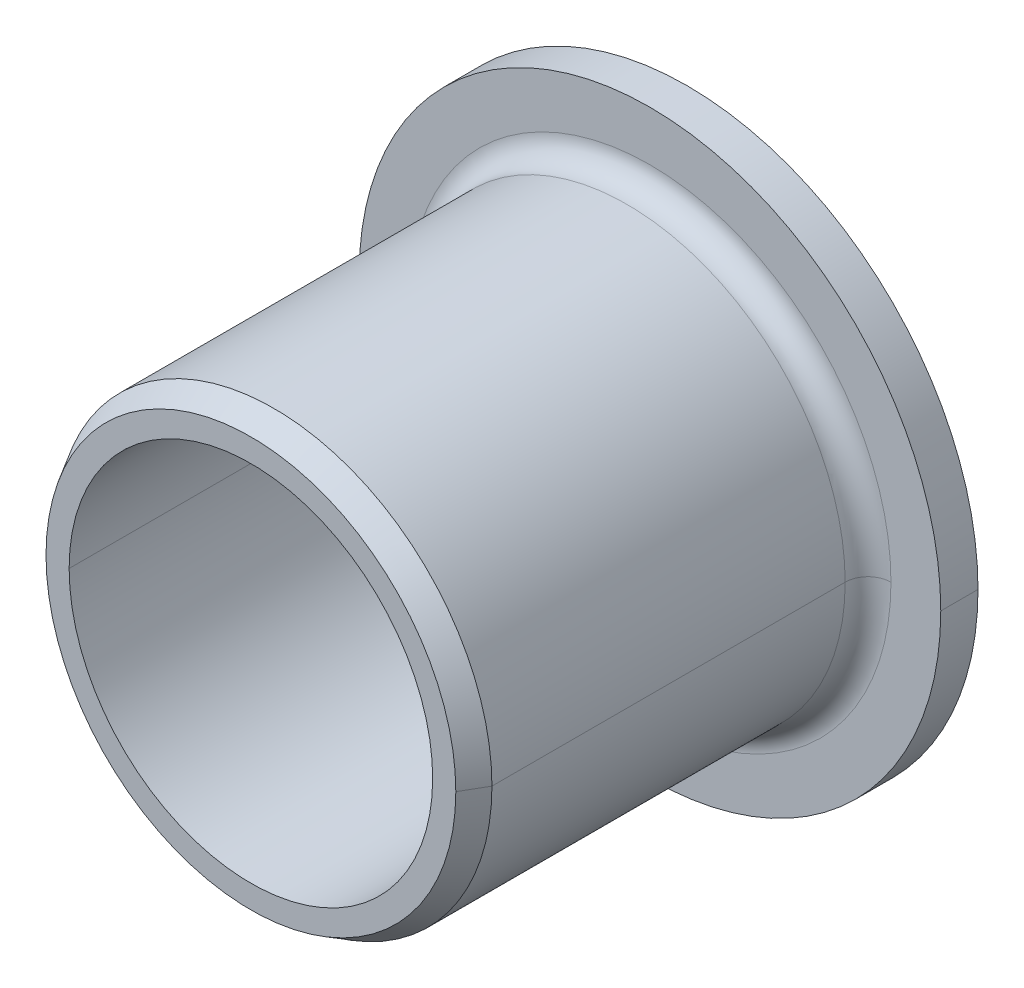
ISO-10303-21;
HEADER;
FILE_DESCRIPTION(('STEP AP214'),'2;1');
FILE_NAME('part.step','',(''),(''),'','','');
FILE_SCHEMA(('AUTOMOTIVE_DESIGN { 1 0 10303 214 1 1 1 1 }'));
ENDSEC;
DATA;
#1=APPLICATION_CONTEXT('core data for automotive mechanical design processes');
#2=APPLICATION_PROTOCOL_DEFINITION('international standard','automotive_design',2000,#1);
#3=PRODUCT_CONTEXT('',#1,'mechanical');
#4=PRODUCT('Part','Part','',(#3));
#5=PRODUCT_RELATED_PRODUCT_CATEGORY('part','',(#4));
#6=PRODUCT_DEFINITION_FORMATION('','',#4);
#7=PRODUCT_DEFINITION_CONTEXT('part definition',#1,'design');
#8=PRODUCT_DEFINITION('design','',#6,#7);
#9=PRODUCT_DEFINITION_SHAPE('','',#8);
#10=(LENGTH_UNIT() NAMED_UNIT(*) SI_UNIT(.MILLI.,.METRE.));
#11=(NAMED_UNIT(*) PLANE_ANGLE_UNIT() SI_UNIT($,.RADIAN.));
#12=(NAMED_UNIT(*) SI_UNIT($,.STERADIAN.) SOLID_ANGLE_UNIT());
#13=UNCERTAINTY_MEASURE_WITH_UNIT(LENGTH_MEASURE(1.E-05),#10,'distance_accuracy_value','');
#14=(GEOMETRIC_REPRESENTATION_CONTEXT(3) GLOBAL_UNCERTAINTY_ASSIGNED_CONTEXT((#13)) GLOBAL_UNIT_ASSIGNED_CONTEXT((#10,
#11,#12)) REPRESENTATION_CONTEXT('',''));
#15=CARTESIAN_POINT('',(0.,0.,0.));
#16=DIRECTION('',(0.,0.,1.));
#17=DIRECTION('',(1.,0.,0.));
#18=AXIS2_PLACEMENT_3D('',#15,#16,#17);
#19=CARTESIAN_POINT('',(5.159375,0.,0.));
#20=DIRECTION('',(0.,0.,-1.));
#21=DIRECTION('',(0.,-1.,0.));
#22=AXIS2_PLACEMENT_3D('',#19,#20,#21);
#23=PLANE('',#22);
#24=CARTESIAN_POINT('',(0.,0.,0.));
#25=DIRECTION('',(0.,0.,1.));
#26=DIRECTION('',(1.,0.,0.));
#27=AXIS2_PLACEMENT_3D('',#24,#25,#26);
#28=CIRCLE('',#27,3.96875);
#29=CARTESIAN_POINT('',(3.96875,0.,0.));
#30=VERTEX_POINT('',#29);
#31=CARTESIAN_POINT('',(-3.96875,0.,0.));
#32=VERTEX_POINT('',#31);
#33=EDGE_CURVE('E11',#30,#32,#28,.T.);
#34=ORIENTED_EDGE('',*,*,#33,.T.);
#35=CARTESIAN_POINT('',(0.,0.,0.));
#36=DIRECTION('',(0.,0.,1.));
#37=DIRECTION('',(1.,0.,0.));
#38=AXIS2_PLACEMENT_3D('',#35,#36,#37);
#39=CIRCLE('',#38,3.96875);
#40=EDGE_CURVE('E20',#32,#30,#39,.T.);
#41=ORIENTED_EDGE('',*,*,#40,.T.);
#42=EDGE_LOOP('',(#34,#41));
#43=FACE_BOUND('',#42,.T.);
#44=CARTESIAN_POINT('',(0.,0.,0.));
#45=DIRECTION('',(0.,0.,1.));
#46=DIRECTION('',(1.,0.,0.));
#47=AXIS2_PLACEMENT_3D('',#44,#45,#46);
#48=CIRCLE('',#47,6.35);
#49=CARTESIAN_POINT('',(6.35,0.,0.));
#50=VERTEX_POINT('',#49);
#51=CARTESIAN_POINT('',(-6.35,0.,0.));
#52=VERTEX_POINT('',#51);
#53=EDGE_CURVE('E128',#50,#52,#48,.T.);
#54=ORIENTED_EDGE('',*,*,#53,.F.);
#55=CARTESIAN_POINT('',(0.,0.,0.));
#56=DIRECTION('',(0.,0.,1.));
#57=DIRECTION('',(1.,0.,0.));
#58=AXIS2_PLACEMENT_3D('',#55,#56,#57);
#59=CIRCLE('',#58,6.35);
#60=EDGE_CURVE('E118',#52,#50,#59,.T.);
#61=ORIENTED_EDGE('',*,*,#60,.F.);
#62=EDGE_LOOP('',(#54,#61));
#63=FACE_BOUND('',#62,.T.);
#64=ADVANCED_FACE('F16',(#43,#63),#23,.T.);
#65=CARTESIAN_POINT('',(0.,0.,4.7625));
#66=DIRECTION('',(0.,0.,1.));
#67=DIRECTION('',(1.,0.,0.));
#68=AXIS2_PLACEMENT_3D('',#65,#66,#67);
#69=CYLINDRICAL_SURFACE('',#68,3.96875);
#70=DIRECTION('',(0.,0.,1.));
#71=VECTOR('',#70,1.);
#72=CARTESIAN_POINT('',(3.96875,0.,4.7625));
#73=LINE('',#72,#71);
#74=CARTESIAN_POINT('',(3.96875,0.,9.525));
#75=VERTEX_POINT('',#74);
#76=EDGE_CURVE('E153',#30,#75,#73,.T.);
#77=ORIENTED_EDGE('',*,*,#76,.T.);
#78=CARTESIAN_POINT('',(0.,0.,9.525));
#79=DIRECTION('',(0.,0.,1.));
#80=DIRECTION('',(1.,0.,0.));
#81=AXIS2_PLACEMENT_3D('',#78,#79,#80);
#82=CIRCLE('',#81,3.96875);
#83=CARTESIAN_POINT('',(-3.96875,0.,9.525));
#84=VERTEX_POINT('',#83);
#85=EDGE_CURVE('E27',#75,#84,#82,.T.);
#86=ORIENTED_EDGE('',*,*,#85,.T.);
#87=DIRECTION('',(0.,0.,-1.));
#88=VECTOR('',#87,1.);
#89=CARTESIAN_POINT('',(-3.96875,0.,4.7625));
#90=LINE('',#89,#88);
#91=EDGE_CURVE('E146',#84,#32,#90,.T.);
#92=ORIENTED_EDGE('',*,*,#91,.T.);
#93=ORIENTED_EDGE('',*,*,#33,.F.);
#94=EDGE_LOOP('',(#77,#86,#92,#93));
#95=FACE_BOUND('',#94,.T.);
#96=ADVANCED_FACE('F232',(#95),#69,.F.);
#97=CARTESIAN_POINT('',(4.2212874327,0.,9.525));
#98=DIRECTION('',(0.,0.,1.));
#99=DIRECTION('',(1.,0.,0.));
#100=AXIS2_PLACEMENT_3D('',#97,#98,#99);
#101=PLANE('',#100);
#102=ORIENTED_EDGE('',*,*,#85,.F.);
#103=CARTESIAN_POINT('',(0.,0.,9.525));
#104=DIRECTION('',(0.,0.,1.));
#105=DIRECTION('',(1.,0.,0.));
#106=AXIS2_PLACEMENT_3D('',#103,#104,#105);
#107=CIRCLE('',#106,3.96875);
#108=EDGE_CURVE('E150',#84,#75,#107,.T.);
#109=ORIENTED_EDGE('',*,*,#108,.F.);
#110=EDGE_LOOP('',(#102,#109));
#111=FACE_BOUND('',#110,.T.);
#112=CARTESIAN_POINT('',(0.,0.,9.525));
#113=DIRECTION('',(0.,0.,1.));
#114=DIRECTION('',(1.,0.,0.));
#115=AXIS2_PLACEMENT_3D('',#112,#113,#114);
#116=CIRCLE('',#115,4.4738248654);
#117=CARTESIAN_POINT('',(4.4738248654,0.,9.525));
#118=VERTEX_POINT('',#117);
#119=CARTESIAN_POINT('',(-4.4738248654,0.,9.525));
#120=VERTEX_POINT('',#119);
#121=EDGE_CURVE('E179',#118,#120,#116,.T.);
#122=ORIENTED_EDGE('',*,*,#121,.T.);
#123=CARTESIAN_POINT('',(0.,0.,9.525));
#124=DIRECTION('',(0.,0.,1.));
#125=DIRECTION('',(1.,0.,0.));
#126=AXIS2_PLACEMENT_3D('',#123,#124,#125);
#127=CIRCLE('',#126,4.4738248654);
#128=EDGE_CURVE('E91',#120,#118,#127,.T.);
#129=ORIENTED_EDGE('',*,*,#128,.T.);
#130=EDGE_LOOP('',(#122,#129));
#131=FACE_BOUND('',#130,.T.);
#132=ADVANCED_FACE('F223',(#111,#131),#101,.T.);
#133=CARTESIAN_POINT('',(0.,0.,9.275));
#134=DIRECTION('',(0.,0.,-1.));
#135=DIRECTION('',(1.,0.,0.));
#136=AXIS2_PLACEMENT_3D('',#133,#134,#135);
#137=CONICAL_SURFACE('',#136,4.6181624327,0.52359877560608);
#138=DIRECTION('',(-0.500000000006738,0.,0.866025403780548));
#139=VECTOR('',#138,1.);
#140=CARTESIAN_POINT('',(4.6181624327,0.,9.275));
#141=LINE('',#140,#139);
#142=CARTESIAN_POINT('',(4.7625,0.,9.025));
#143=VERTEX_POINT('',#142);
#144=EDGE_CURVE('E173',#143,#118,#141,.T.);
#145=ORIENTED_EDGE('',*,*,#144,.T.);
#146=ORIENTED_EDGE('',*,*,#128,.F.);
#147=DIRECTION('',(-0.500000000006738,0.,-0.866025403780548));
#148=VECTOR('',#147,1.);
#149=CARTESIAN_POINT('',(-4.6181624327,0.,9.275));
#150=LINE('',#149,#148);
#151=CARTESIAN_POINT('',(-4.7625,0.,9.025));
#152=VERTEX_POINT('',#151);
#153=EDGE_CURVE('E177',#120,#152,#150,.T.);
#154=ORIENTED_EDGE('',*,*,#153,.T.);
#155=CARTESIAN_POINT('',(0.,0.,9.025));
#156=DIRECTION('',(0.,0.,1.));
#157=DIRECTION('',(1.,0.,0.));
#158=AXIS2_PLACEMENT_3D('',#155,#156,#157);
#159=CIRCLE('',#158,4.7625);
#160=EDGE_CURVE('E99',#152,#143,#159,.T.);
#161=ORIENTED_EDGE('',*,*,#160,.T.);
#162=EDGE_LOOP('',(#145,#146,#154,#161));
#163=FACE_BOUND('',#162,.T.);
#164=ADVANCED_FACE('F221',(#163),#137,.T.);
#165=CARTESIAN_POINT('',(0.,0.,5.1689));
#166=DIRECTION('',(0.,0.,1.));
#167=DIRECTION('',(1.,0.,0.));
#168=AXIS2_PLACEMENT_3D('',#165,#166,#167);
#169=CYLINDRICAL_SURFACE('',#168,4.7625);
#170=DIRECTION('',(0.,0.,1.));
#171=VECTOR('',#170,1.);
#172=CARTESIAN_POINT('',(4.7625,0.,5.1689));
#173=LINE('',#172,#171);
#174=CARTESIAN_POINT('',(4.7625,0.,1.3128));
#175=VERTEX_POINT('',#174);
#176=EDGE_CURVE('E164',#175,#143,#173,.T.);
#177=ORIENTED_EDGE('',*,*,#176,.T.);
#178=ORIENTED_EDGE('',*,*,#160,.F.);
#179=DIRECTION('',(0.,0.,-1.));
#180=VECTOR('',#179,1.);
#181=CARTESIAN_POINT('',(-4.7625,0.,5.1689));
#182=LINE('',#181,#180);
#183=CARTESIAN_POINT('',(-4.7625,0.,1.3128));
#184=VERTEX_POINT('',#183);
#185=EDGE_CURVE('E163',#152,#184,#182,.T.);
#186=ORIENTED_EDGE('',*,*,#185,.T.);
#187=CARTESIAN_POINT('',(0.,0.,1.3128));
#188=DIRECTION('',(0.,0.,1.));
#189=DIRECTION('',(1.,0.,0.));
#190=AXIS2_PLACEMENT_3D('',#187,#188,#189);
#191=CIRCLE('',#190,4.7625);
#192=EDGE_CURVE('E136',#184,#175,#191,.T.);
#193=ORIENTED_EDGE('',*,*,#192,.T.);
#194=EDGE_LOOP('',(#177,#178,#186,#193));
#195=FACE_BOUND('',#194,.T.);
#196=ADVANCED_FACE('F208',(#195),#169,.T.);
#197=CARTESIAN_POINT('',(0.,0.,1.3128));
#198=DIRECTION('',(0.,0.,1.));
#199=DIRECTION('',(1.,0.,0.));
#200=AXIS2_PLACEMENT_3D('',#197,#198,#199);
#201=TOROIDAL_SURFACE('',#200,5.2625,0.5);
#202=CARTESIAN_POINT('',(-5.2625,0.,1.3128));
#203=DIRECTION('',(0.,-1.,0.));
#204=DIRECTION('',(-1.,0.,0.));
#205=AXIS2_PLACEMENT_3D('',#202,#203,#204);
#206=CIRCLE('',#205,0.5);
#207=CARTESIAN_POINT('',(-5.2625,0.,0.8128));
#208=VERTEX_POINT('',#207);
#209=EDGE_CURVE('E186',#208,#184,#206,.T.);
#210=ORIENTED_EDGE('',*,*,#209,.T.);
#211=CARTESIAN_POINT('',(0.,0.,1.3128));
#212=DIRECTION('',(0.,0.,1.));
#213=DIRECTION('',(1.,0.,0.));
#214=AXIS2_PLACEMENT_3D('',#211,#212,#213);
#215=CIRCLE('',#214,4.7625);
#216=EDGE_CURVE('E159',#175,#184,#215,.T.);
#217=ORIENTED_EDGE('',*,*,#216,.F.);
#218=CARTESIAN_POINT('',(5.2625,0.,1.3128));
#219=DIRECTION('',(0.,-1.,0.));
#220=DIRECTION('',(1.,0.,0.));
#221=AXIS2_PLACEMENT_3D('',#218,#219,#220);
#222=CIRCLE('',#221,0.5);
#223=CARTESIAN_POINT('',(5.2625,0.,0.8128));
#224=VERTEX_POINT('',#223);
#225=EDGE_CURVE('E141',#175,#224,#222,.T.);
#226=ORIENTED_EDGE('',*,*,#225,.T.);
#227=CARTESIAN_POINT('',(0.,0.,0.8128));
#228=DIRECTION('',(0.,0.,1.));
#229=DIRECTION('',(1.,0.,0.));
#230=AXIS2_PLACEMENT_3D('',#227,#228,#229);
#231=CIRCLE('',#230,5.2625);
#232=EDGE_CURVE('E113',#224,#208,#231,.T.);
#233=ORIENTED_EDGE('',*,*,#232,.T.);
#234=EDGE_LOOP('',(#210,#217,#226,#233));
#235=FACE_BOUND('',#234,.T.);
#236=ADVANCED_FACE('F230',(#235),#201,.F.);
#237=CARTESIAN_POINT('',(5.80625,0.,0.8128));
#238=DIRECTION('',(0.,0.,1.));
#239=DIRECTION('',(1.,0.,0.));
#240=AXIS2_PLACEMENT_3D('',#237,#238,#239);
#241=PLANE('',#240);
#242=ORIENTED_EDGE('',*,*,#232,.F.);
#243=CARTESIAN_POINT('',(0.,0.,0.8128));
#244=DIRECTION('',(0.,0.,1.));
#245=DIRECTION('',(1.,0.,0.));
#246=AXIS2_PLACEMENT_3D('',#243,#244,#245);
#247=CIRCLE('',#246,5.2625);
#248=EDGE_CURVE('E169',#208,#224,#247,.T.);
#249=ORIENTED_EDGE('',*,*,#248,.F.);
#250=EDGE_LOOP('',(#242,#249));
#251=FACE_BOUND('',#250,.T.);
#252=CARTESIAN_POINT('',(0.,0.,0.8128));
#253=DIRECTION('',(0.,0.,1.));
#254=DIRECTION('',(1.,0.,0.));
#255=AXIS2_PLACEMENT_3D('',#252,#253,#254);
#256=CIRCLE('',#255,6.35);
#257=CARTESIAN_POINT('',(6.35,0.,0.8128));
#258=VERTEX_POINT('',#257);
#259=CARTESIAN_POINT('',(-6.35,0.,0.8128));
#260=VERTEX_POINT('',#259);
#261=EDGE_CURVE('E134',#258,#260,#256,.T.);
#262=ORIENTED_EDGE('',*,*,#261,.T.);
#263=CARTESIAN_POINT('',(0.,0.,0.8128));
#264=DIRECTION('',(0.,0.,1.));
#265=DIRECTION('',(1.,0.,0.));
#266=AXIS2_PLACEMENT_3D('',#263,#264,#265);
#267=CIRCLE('',#266,6.35);
#268=EDGE_CURVE('E41',#260,#258,#267,.T.);
#269=ORIENTED_EDGE('',*,*,#268,.T.);
#270=EDGE_LOOP('',(#262,#269));
#271=FACE_BOUND('',#270,.T.);
#272=ADVANCED_FACE('F245',(#251,#271),#241,.T.);
#273=CARTESIAN_POINT('',(0.,0.,0.4064));
#274=DIRECTION('',(0.,0.,1.));
#275=DIRECTION('',(1.,0.,0.));
#276=AXIS2_PLACEMENT_3D('',#273,#274,#275);
#277=CYLINDRICAL_SURFACE('',#276,6.35);
#278=DIRECTION('',(0.,0.,1.));
#279=VECTOR('',#278,1.);
#280=CARTESIAN_POINT('',(6.35,0.,0.4064));
#281=LINE('',#280,#279);
#282=EDGE_CURVE('E121',#50,#258,#281,.T.);
#283=ORIENTED_EDGE('',*,*,#282,.T.);
#284=ORIENTED_EDGE('',*,*,#268,.F.);
#285=DIRECTION('',(0.,0.,-1.));
#286=VECTOR('',#285,1.);
#287=CARTESIAN_POINT('',(-6.35,0.,0.4064));
#288=LINE('',#287,#286);
#289=EDGE_CURVE('E123',#260,#52,#288,.T.);
#290=ORIENTED_EDGE('',*,*,#289,.T.);
#291=ORIENTED_EDGE('',*,*,#60,.T.);
#292=EDGE_LOOP('',(#283,#284,#290,#291));
#293=FACE_BOUND('',#292,.T.);
#294=ADVANCED_FACE('F18',(#293),#277,.T.);
#295=CARTESIAN_POINT('',(0.,0.,0.4064));
#296=DIRECTION('',(0.,0.,1.));
#297=DIRECTION('',(1.,0.,0.));
#298=AXIS2_PLACEMENT_3D('',#295,#296,#297);
#299=CYLINDRICAL_SURFACE('',#298,6.35);
#300=ORIENTED_EDGE('',*,*,#282,.F.);
#301=ORIENTED_EDGE('',*,*,#53,.T.);
#302=ORIENTED_EDGE('',*,*,#289,.F.);
#303=ORIENTED_EDGE('',*,*,#261,.F.);
#304=EDGE_LOOP('',(#300,#301,#302,#303));
#305=FACE_BOUND('',#304,.T.);
#306=ADVANCED_FACE('F133',(#305),#299,.T.);
#307=CARTESIAN_POINT('',(0.,0.,1.3128));
#308=DIRECTION('',(0.,0.,1.));
#309=DIRECTION('',(1.,0.,0.));
#310=AXIS2_PLACEMENT_3D('',#307,#308,#309);
#311=TOROIDAL_SURFACE('',#310,5.2625,0.5);
#312=ORIENTED_EDGE('',*,*,#209,.F.);
#313=ORIENTED_EDGE('',*,*,#248,.T.);
#314=ORIENTED_EDGE('',*,*,#225,.F.);
#315=ORIENTED_EDGE('',*,*,#192,.F.);
#316=EDGE_LOOP('',(#312,#313,#314,#315));
#317=FACE_BOUND('',#316,.T.);
#318=ADVANCED_FACE('F248',(#317),#311,.F.);
#319=CARTESIAN_POINT('',(0.,0.,5.1689));
#320=DIRECTION('',(0.,0.,1.));
#321=DIRECTION('',(1.,0.,0.));
#322=AXIS2_PLACEMENT_3D('',#319,#320,#321);
#323=CYLINDRICAL_SURFACE('',#322,4.7625);
#324=ORIENTED_EDGE('',*,*,#176,.F.);
#325=ORIENTED_EDGE('',*,*,#216,.T.);
#326=ORIENTED_EDGE('',*,*,#185,.F.);
#327=CARTESIAN_POINT('',(0.,0.,9.025));
#328=DIRECTION('',(0.,0.,1.));
#329=DIRECTION('',(1.,0.,0.));
#330=AXIS2_PLACEMENT_3D('',#327,#328,#329);
#331=CIRCLE('',#330,4.7625);
#332=EDGE_CURVE('E174',#143,#152,#331,.T.);
#333=ORIENTED_EDGE('',*,*,#332,.F.);
#334=EDGE_LOOP('',(#324,#325,#326,#333));
#335=FACE_BOUND('',#334,.T.);
#336=ADVANCED_FACE('F212',(#335),#323,.T.);
#337=CARTESIAN_POINT('',(0.,0.,9.275));
#338=DIRECTION('',(0.,0.,-1.));
#339=DIRECTION('',(1.,0.,0.));
#340=AXIS2_PLACEMENT_3D('',#337,#338,#339);
#341=CONICAL_SURFACE('',#340,4.6181624327,0.52359877560608);
#342=ORIENTED_EDGE('',*,*,#144,.F.);
#343=ORIENTED_EDGE('',*,*,#332,.T.);
#344=ORIENTED_EDGE('',*,*,#153,.F.);
#345=ORIENTED_EDGE('',*,*,#121,.F.);
#346=EDGE_LOOP('',(#342,#343,#344,#345));
#347=FACE_BOUND('',#346,.T.);
#348=ADVANCED_FACE('F215',(#347),#341,.T.);
#349=CARTESIAN_POINT('',(0.,0.,4.7625));
#350=DIRECTION('',(0.,0.,1.));
#351=DIRECTION('',(1.,0.,0.));
#352=AXIS2_PLACEMENT_3D('',#349,#350,#351);
#353=CYLINDRICAL_SURFACE('',#352,3.96875);
#354=ORIENTED_EDGE('',*,*,#76,.F.);
#355=ORIENTED_EDGE('',*,*,#40,.F.);
#356=ORIENTED_EDGE('',*,*,#91,.F.);
#357=ORIENTED_EDGE('',*,*,#108,.T.);
#358=EDGE_LOOP('',(#354,#355,#356,#357));
#359=FACE_BOUND('',#358,.T.);
#360=ADVANCED_FACE('F254',(#359),#353,.F.);
#361=CLOSED_SHELL('',(#64,#96,#132,#164,#196,#236,#272,#294,#306,#318,#336,#348,#360));
#362=MANIFOLD_SOLID_BREP('B1',#361);
#363=ADVANCED_BREP_SHAPE_REPRESENTATION('',(#18,#362),#14);
#364=SHAPE_DEFINITION_REPRESENTATION(#9,#363);
ENDSEC;
END-ISO-10303-21;
